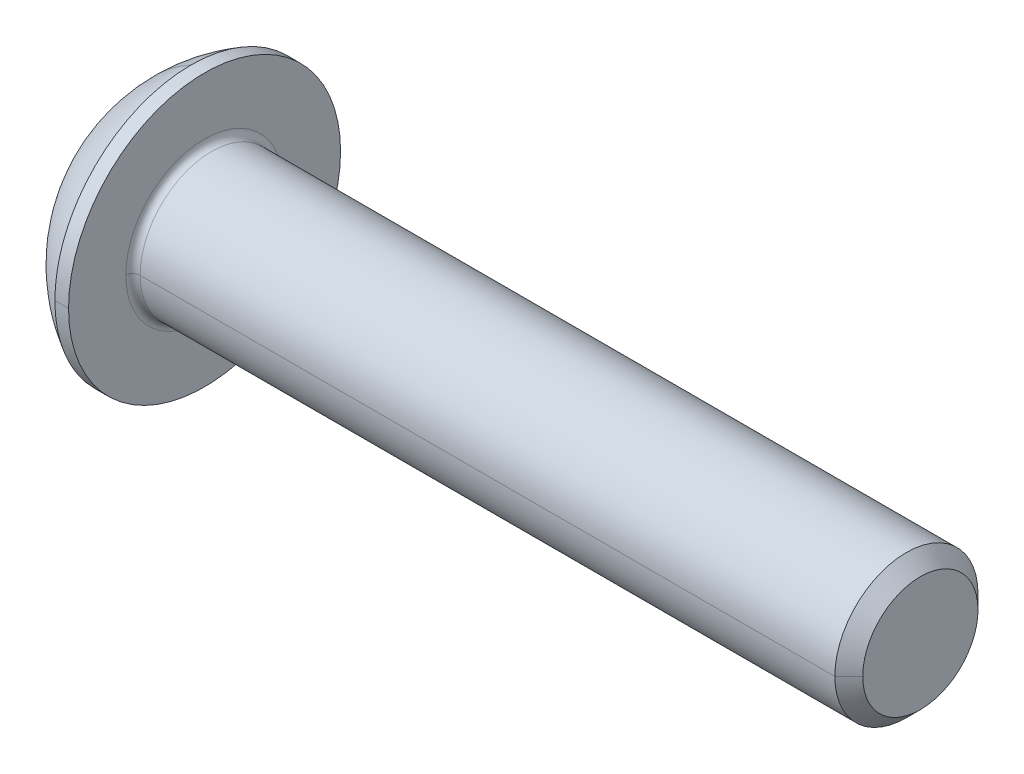
ISO-10303-21;
HEADER;
FILE_DESCRIPTION(('STEP AP214'),'2;1');
FILE_NAME('part.step','',(''),(''),'','','');
FILE_SCHEMA(('AUTOMOTIVE_DESIGN { 1 0 10303 214 1 1 1 1 }'));
ENDSEC;
DATA;
#1=APPLICATION_CONTEXT('core data for automotive mechanical design processes');
#2=APPLICATION_PROTOCOL_DEFINITION('international standard','automotive_design',2000,#1);
#3=PRODUCT_CONTEXT('',#1,'mechanical');
#4=PRODUCT('Part','Part','',(#3));
#5=PRODUCT_RELATED_PRODUCT_CATEGORY('part','',(#4));
#6=PRODUCT_DEFINITION_FORMATION('','',#4);
#7=PRODUCT_DEFINITION_CONTEXT('part definition',#1,'design');
#8=PRODUCT_DEFINITION('design','',#6,#7);
#9=PRODUCT_DEFINITION_SHAPE('','',#8);
#10=(LENGTH_UNIT() NAMED_UNIT(*) SI_UNIT(.MILLI.,.METRE.));
#11=(NAMED_UNIT(*) PLANE_ANGLE_UNIT() SI_UNIT($,.RADIAN.));
#12=(NAMED_UNIT(*) SI_UNIT($,.STERADIAN.) SOLID_ANGLE_UNIT());
#13=UNCERTAINTY_MEASURE_WITH_UNIT(LENGTH_MEASURE(1.E-05),#10,'distance_accuracy_value','');
#14=(GEOMETRIC_REPRESENTATION_CONTEXT(3) GLOBAL_UNCERTAINTY_ASSIGNED_CONTEXT((#13)) GLOBAL_UNIT_ASSIGNED_CONTEXT((#10,
#11,#12)) REPRESENTATION_CONTEXT('',''));
#15=CARTESIAN_POINT('',(0.,0.,0.));
#16=DIRECTION('',(0.,0.,1.));
#17=DIRECTION('',(1.,0.,0.));
#18=AXIS2_PLACEMENT_3D('',#15,#16,#17);
#19=CARTESIAN_POINT('',(-997.978312163513,0.,0.));
#20=DIRECTION('',(-1.,0.,0.));
#21=DIRECTION('',(0.,0.,1.));
#22=AXIS2_PLACEMENT_3D('',#19,#20,#21);
#23=CONICAL_SURFACE('',#22,1732.05080756885,1.0471975511966);
#24=DIRECTION('',(-0.5,0.,-0.866025403784436));
#25=VECTOR('',#24,1.);
#26=CARTESIAN_POINT('',(2.02168783648704,0.,0.));
#27=LINE('',#26,#25);
#28=CARTESIAN_POINT('',(2.02168783648704,0.,0.));
#29=VERTEX_POINT('',#28);
#30=CARTESIAN_POINT('',(1.3,0.,-1.25));
#31=VERTEX_POINT('',#30);
#32=EDGE_CURVE('E184',#29,#31,#27,.T.);
#33=ORIENTED_EDGE('',*,*,#32,.F.);
#34=DIRECTION('',(-0.5,0.,0.866025403784436));
#35=VECTOR('',#34,1.);
#36=CARTESIAN_POINT('',(2.02168783648704,0.,0.));
#37=LINE('',#36,#35);
#38=CARTESIAN_POINT('',(1.3,0.,1.25));
#39=VERTEX_POINT('',#38);
#40=EDGE_CURVE('E223',#29,#39,#37,.T.);
#41=ORIENTED_EDGE('',*,*,#40,.T.);
#42=CARTESIAN_POINT('',(1.3,0.,0.));
#43=DIRECTION('',(-1.,0.,0.));
#44=DIRECTION('',(0.,0.,1.));
#45=AXIS2_PLACEMENT_3D('',#42,#43,#44);
#46=CIRCLE('',#45,1.25);
#47=CARTESIAN_POINT('',(1.3,1.08253175473055,0.625));
#48=VERTEX_POINT('',#47);
#49=EDGE_CURVE('E11',#39,#48,#46,.T.);
#50=ORIENTED_EDGE('',*,*,#49,.T.);
#51=CARTESIAN_POINT('',(1.3,0.,0.));
#52=DIRECTION('',(-1.,0.,0.));
#53=DIRECTION('',(0.,0.,1.));
#54=AXIS2_PLACEMENT_3D('',#51,#52,#53);
#55=CIRCLE('',#54,1.25);
#56=CARTESIAN_POINT('',(1.3,1.08253175473055,-0.625));
#57=VERTEX_POINT('',#56);
#58=EDGE_CURVE('E20',#48,#57,#55,.T.);
#59=ORIENTED_EDGE('',*,*,#58,.T.);
#60=CARTESIAN_POINT('',(1.3,0.,0.));
#61=DIRECTION('',(-1.,0.,0.));
#62=DIRECTION('',(0.,0.,1.));
#63=AXIS2_PLACEMENT_3D('',#60,#61,#62);
#64=CIRCLE('',#63,1.25);
#65=EDGE_CURVE('E181',#57,#31,#64,.T.);
#66=ORIENTED_EDGE('',*,*,#65,.T.);
#67=EDGE_LOOP('',(#33,#41,#50,#59,#66));
#68=FACE_BOUND('',#67,.T.);
#69=ADVANCED_FACE('F16',(#68),#23,.F.);
#70=CARTESIAN_POINT('',(1.3,-1.44337567297406,0.));
#71=DIRECTION('',(1.,0.,0.));
#72=DIRECTION('',(0.,1.,0.));
#73=AXIS2_PLACEMENT_3D('',#70,#71,#72);
#74=PLANE('',#73);
#75=CARTESIAN_POINT('',(1.3,0.,0.));
#76=DIRECTION('',(-1.,0.,0.));
#77=DIRECTION('',(0.,0.,1.));
#78=AXIS2_PLACEMENT_3D('',#75,#76,#77);
#79=CIRCLE('',#78,1.25);
#80=CARTESIAN_POINT('',(1.3,-1.08253175473055,-0.625));
#81=VERTEX_POINT('',#80);
#82=EDGE_CURVE('E213',#31,#81,#79,.T.);
#83=ORIENTED_EDGE('',*,*,#82,.F.);
#84=DIRECTION('',(0.,1.,0.));
#85=VECTOR('',#84,1.);
#86=CARTESIAN_POINT('',(1.3,0.721687836487033,-1.25));
#87=LINE('',#86,#85);
#88=CARTESIAN_POINT('',(1.3,-0.721687836487032,-1.25));
#89=VERTEX_POINT('',#88);
#90=EDGE_CURVE('E201',#89,#31,#87,.T.);
#91=ORIENTED_EDGE('',*,*,#90,.F.);
#92=DIRECTION('',(0.,0.5,-0.866025403784439));
#93=VECTOR('',#92,1.);
#94=CARTESIAN_POINT('',(1.3,-0.721687836487032,-1.25));
#95=LINE('',#94,#93);
#96=EDGE_CURVE('E214',#81,#89,#95,.T.);
#97=ORIENTED_EDGE('',*,*,#96,.F.);
#98=EDGE_LOOP('',(#83,#91,#97));
#99=FACE_BOUND('',#98,.T.);
#100=ADVANCED_FACE('F18',(#99),#74,.F.);
#101=CARTESIAN_POINT('',(1.3,-1.44337567297406,0.));
#102=DIRECTION('',(1.,0.,0.));
#103=DIRECTION('',(0.,1.,0.));
#104=AXIS2_PLACEMENT_3D('',#101,#102,#103);
#105=PLANE('',#104);
#106=CARTESIAN_POINT('',(1.3,0.,0.));
#107=DIRECTION('',(-1.,0.,0.));
#108=DIRECTION('',(0.,0.,1.));
#109=AXIS2_PLACEMENT_3D('',#106,#107,#108);
#110=CIRCLE('',#109,1.25);
#111=CARTESIAN_POINT('',(1.3,-1.08253175473055,0.625));
#112=VERTEX_POINT('',#111);
#113=EDGE_CURVE('E219',#81,#112,#110,.T.);
#114=ORIENTED_EDGE('',*,*,#113,.F.);
#115=DIRECTION('',(0.,0.5,-0.866025403784439));
#116=VECTOR('',#115,1.);
#117=CARTESIAN_POINT('',(1.3,-0.721687836487032,-1.25));
#118=LINE('',#117,#116);
#119=CARTESIAN_POINT('',(1.3,-1.44337567297406,0.));
#120=VERTEX_POINT('',#119);
#121=EDGE_CURVE('E374',#120,#81,#118,.T.);
#122=ORIENTED_EDGE('',*,*,#121,.F.);
#123=DIRECTION('',(0.,-0.5,-0.866025403784439));
#124=VECTOR('',#123,1.);
#125=CARTESIAN_POINT('',(1.3,-1.44337567297406,0.));
#126=LINE('',#125,#124);
#127=EDGE_CURVE('E306',#112,#120,#126,.T.);
#128=ORIENTED_EDGE('',*,*,#127,.F.);
#129=EDGE_LOOP('',(#114,#122,#128));
#130=FACE_BOUND('',#129,.T.);
#131=ADVANCED_FACE('F414',(#130),#105,.F.);
#132=CARTESIAN_POINT('',(1.3,-1.44337567297406,0.));
#133=DIRECTION('',(1.,0.,0.));
#134=DIRECTION('',(0.,1.,0.));
#135=AXIS2_PLACEMENT_3D('',#132,#133,#134);
#136=PLANE('',#135);
#137=CARTESIAN_POINT('',(1.3,0.,0.));
#138=DIRECTION('',(-1.,0.,0.));
#139=DIRECTION('',(0.,0.,1.));
#140=AXIS2_PLACEMENT_3D('',#137,#138,#139);
#141=CIRCLE('',#140,1.25);
#142=EDGE_CURVE('E241',#112,#39,#141,.T.);
#143=ORIENTED_EDGE('',*,*,#142,.F.);
#144=DIRECTION('',(0.,-0.5,-0.866025403784439));
#145=VECTOR('',#144,1.);
#146=CARTESIAN_POINT('',(1.3,-1.44337567297406,0.));
#147=LINE('',#146,#145);
#148=CARTESIAN_POINT('',(1.3,-0.721687836487032,1.25));
#149=VERTEX_POINT('',#148);
#150=EDGE_CURVE('E365',#149,#112,#147,.T.);
#151=ORIENTED_EDGE('',*,*,#150,.F.);
#152=DIRECTION('',(0.,-1.,0.));
#153=VECTOR('',#152,1.);
#154=CARTESIAN_POINT('',(1.3,-0.721687836487032,1.25));
#155=LINE('',#154,#153);
#156=EDGE_CURVE('E189',#39,#149,#155,.T.);
#157=ORIENTED_EDGE('',*,*,#156,.F.);
#158=EDGE_LOOP('',(#143,#151,#157));
#159=FACE_BOUND('',#158,.T.);
#160=ADVANCED_FACE('F411',(#159),#136,.F.);
#161=CARTESIAN_POINT('',(1.3,-1.44337567297406,0.));
#162=DIRECTION('',(1.,0.,0.));
#163=DIRECTION('',(0.,1.,0.));
#164=AXIS2_PLACEMENT_3D('',#161,#162,#163);
#165=PLANE('',#164);
#166=ORIENTED_EDGE('',*,*,#49,.F.);
#167=DIRECTION('',(0.,-1.,0.));
#168=VECTOR('',#167,1.);
#169=CARTESIAN_POINT('',(1.3,-0.721687836487032,1.25));
#170=LINE('',#169,#168);
#171=CARTESIAN_POINT('',(1.3,0.721687836487033,1.25));
#172=VERTEX_POINT('',#171);
#173=EDGE_CURVE('E39',#172,#39,#170,.T.);
#174=ORIENTED_EDGE('',*,*,#173,.F.);
#175=DIRECTION('',(0.,-0.5,0.866025403784439));
#176=VECTOR('',#175,1.);
#177=CARTESIAN_POINT('',(1.3,0.721687836487033,1.25));
#178=LINE('',#177,#176);
#179=EDGE_CURVE('E381',#48,#172,#178,.T.);
#180=ORIENTED_EDGE('',*,*,#179,.F.);
#181=EDGE_LOOP('',(#166,#174,#180));
#182=FACE_BOUND('',#181,.T.);
#183=ADVANCED_FACE('F426',(#182),#165,.F.);
#184=CARTESIAN_POINT('',(1.3,-1.44337567297406,0.));
#185=DIRECTION('',(1.,0.,0.));
#186=DIRECTION('',(0.,1.,0.));
#187=AXIS2_PLACEMENT_3D('',#184,#185,#186);
#188=PLANE('',#187);
#189=ORIENTED_EDGE('',*,*,#58,.F.);
#190=DIRECTION('',(0.,-0.5,0.866025403784439));
#191=VECTOR('',#190,1.);
#192=CARTESIAN_POINT('',(1.3,0.721687836487033,1.25));
#193=LINE('',#192,#191);
#194=CARTESIAN_POINT('',(1.3,1.44337567297406,0.));
#195=VERTEX_POINT('',#194);
#196=EDGE_CURVE('E319',#195,#48,#193,.T.);
#197=ORIENTED_EDGE('',*,*,#196,.F.);
#198=DIRECTION('',(0.,0.5,0.866025403784439));
#199=VECTOR('',#198,1.);
#200=CARTESIAN_POINT('',(1.3,1.44337567297406,0.));
#201=LINE('',#200,#199);
#202=EDGE_CURVE('E320',#57,#195,#201,.T.);
#203=ORIENTED_EDGE('',*,*,#202,.F.);
#204=EDGE_LOOP('',(#189,#197,#203));
#205=FACE_BOUND('',#204,.T.);
#206=ADVANCED_FACE('F428',(#205),#188,.F.);
#207=CARTESIAN_POINT('',(1.3,-1.44337567297406,0.));
#208=DIRECTION('',(1.,0.,0.));
#209=DIRECTION('',(0.,1.,0.));
#210=AXIS2_PLACEMENT_3D('',#207,#208,#209);
#211=PLANE('',#210);
#212=ORIENTED_EDGE('',*,*,#65,.F.);
#213=DIRECTION('',(0.,0.5,0.866025403784439));
#214=VECTOR('',#213,1.);
#215=CARTESIAN_POINT('',(1.3,1.44337567297406,0.));
#216=LINE('',#215,#214);
#217=CARTESIAN_POINT('',(1.3,0.721687836487033,-1.25));
#218=VERTEX_POINT('',#217);
#219=EDGE_CURVE('E196',#218,#57,#216,.T.);
#220=ORIENTED_EDGE('',*,*,#219,.F.);
#221=DIRECTION('',(0.,1.,0.));
#222=VECTOR('',#221,1.);
#223=CARTESIAN_POINT('',(1.3,0.721687836487033,-1.25));
#224=LINE('',#223,#222);
#225=EDGE_CURVE('E192',#31,#218,#224,.T.);
#226=ORIENTED_EDGE('',*,*,#225,.F.);
#227=EDGE_LOOP('',(#212,#220,#226));
#228=FACE_BOUND('',#227,.T.);
#229=ADVANCED_FACE('F194',(#228),#211,.F.);
#230=CARTESIAN_POINT('',(1.3,-0.721687836487032,1.25));
#231=DIRECTION('',(0.,0.,-1.));
#232=DIRECTION('',(0.,-1.,0.));
#233=AXIS2_PLACEMENT_3D('',#230,#231,#232);
#234=PLANE('',#233);
#235=ORIENTED_EDGE('',*,*,#173,.T.);
#236=ORIENTED_EDGE('',*,*,#156,.T.);
#237=DIRECTION('',(-1.,0.,0.));
#238=VECTOR('',#237,1.);
#239=CARTESIAN_POINT('',(1.3,-0.721687836487032,1.25));
#240=LINE('',#239,#238);
#241=CARTESIAN_POINT('',(0.,-0.721687836487032,1.25));
#242=VERTEX_POINT('',#241);
#243=EDGE_CURVE('E305',#149,#242,#240,.T.);
#244=ORIENTED_EDGE('',*,*,#243,.T.);
#245=DIRECTION('',(0.,-1.,0.));
#246=VECTOR('',#245,1.);
#247=CARTESIAN_POINT('',(0.,-0.721687836487032,1.25));
#248=LINE('',#247,#246);
#249=CARTESIAN_POINT('',(0.,0.721687836487033,1.25));
#250=VERTEX_POINT('',#249);
#251=EDGE_CURVE('E326',#250,#242,#248,.T.);
#252=ORIENTED_EDGE('',*,*,#251,.F.);
#253=DIRECTION('',(-1.,0.,0.));
#254=VECTOR('',#253,1.);
#255=CARTESIAN_POINT('',(1.3,0.721687836487033,1.25));
#256=LINE('',#255,#254);
#257=EDGE_CURVE('E385',#172,#250,#256,.T.);
#258=ORIENTED_EDGE('',*,*,#257,.F.);
#259=EDGE_LOOP('',(#235,#236,#244,#252,#258));
#260=FACE_BOUND('',#259,.T.);
#261=ADVANCED_FACE('F403',(#260),#234,.T.);
#262=CARTESIAN_POINT('',(1.3,0.721687836487033,1.25));
#263=DIRECTION('',(0.,-0.866025403784439,-0.5));
#264=DIRECTION('',(0.,0.5,-0.866025403784439));
#265=AXIS2_PLACEMENT_3D('',#262,#263,#264);
#266=PLANE('',#265);
#267=ORIENTED_EDGE('',*,*,#196,.T.);
#268=ORIENTED_EDGE('',*,*,#179,.T.);
#269=ORIENTED_EDGE('',*,*,#257,.T.);
#270=DIRECTION('',(0.,-0.5,0.866025403784439));
#271=VECTOR('',#270,1.);
#272=CARTESIAN_POINT('',(0.,0.721687836487033,1.25));
#273=LINE('',#272,#271);
#274=CARTESIAN_POINT('',(0.,1.44337567297406,0.));
#275=VERTEX_POINT('',#274);
#276=EDGE_CURVE('E346',#275,#250,#273,.T.);
#277=ORIENTED_EDGE('',*,*,#276,.F.);
#278=DIRECTION('',(-1.,0.,0.));
#279=VECTOR('',#278,1.);
#280=CARTESIAN_POINT('',(1.3,1.44337567297406,0.));
#281=LINE('',#280,#279);
#282=EDGE_CURVE('E316',#195,#275,#281,.T.);
#283=ORIENTED_EDGE('',*,*,#282,.F.);
#284=EDGE_LOOP('',(#267,#268,#269,#277,#283));
#285=FACE_BOUND('',#284,.T.);
#286=ADVANCED_FACE('F424',(#285),#266,.T.);
#287=CARTESIAN_POINT('',(1.3,1.44337567297406,0.));
#288=DIRECTION('',(0.,-0.866025403784439,0.5));
#289=DIRECTION('',(-1.,0.,0.));
#290=AXIS2_PLACEMENT_3D('',#287,#288,#289);
#291=PLANE('',#290);
#292=ORIENTED_EDGE('',*,*,#219,.T.);
#293=ORIENTED_EDGE('',*,*,#202,.T.);
#294=ORIENTED_EDGE('',*,*,#282,.T.);
#295=DIRECTION('',(0.,0.5,0.866025403784439));
#296=VECTOR('',#295,1.);
#297=CARTESIAN_POINT('',(0.,1.44337567297406,0.));
#298=LINE('',#297,#296);
#299=CARTESIAN_POINT('',(0.,0.721687836487033,-1.25));
#300=VERTEX_POINT('',#299);
#301=EDGE_CURVE('E342',#300,#275,#298,.T.);
#302=ORIENTED_EDGE('',*,*,#301,.F.);
#303=DIRECTION('',(-1.,0.,0.));
#304=VECTOR('',#303,1.);
#305=CARTESIAN_POINT('',(1.3,0.721687836487033,-1.25));
#306=LINE('',#305,#304);
#307=EDGE_CURVE('E200',#218,#300,#306,.T.);
#308=ORIENTED_EDGE('',*,*,#307,.F.);
#309=EDGE_LOOP('',(#292,#293,#294,#302,#308));
#310=FACE_BOUND('',#309,.T.);
#311=ADVANCED_FACE('F449',(#310),#291,.T.);
#312=CARTESIAN_POINT('',(1.3,0.721687836487033,-1.25));
#313=DIRECTION('',(0.,0.,1.));
#314=DIRECTION('',(1.,0.,0.));
#315=AXIS2_PLACEMENT_3D('',#312,#313,#314);
#316=PLANE('',#315);
#317=ORIENTED_EDGE('',*,*,#90,.T.);
#318=ORIENTED_EDGE('',*,*,#225,.T.);
#319=ORIENTED_EDGE('',*,*,#307,.T.);
#320=DIRECTION('',(0.,1.,0.));
#321=VECTOR('',#320,1.);
#322=CARTESIAN_POINT('',(0.,0.721687836487033,-1.25));
#323=LINE('',#322,#321);
#324=CARTESIAN_POINT('',(0.,-0.721687836487032,-1.25));
#325=VERTEX_POINT('',#324);
#326=EDGE_CURVE('E338',#325,#300,#323,.T.);
#327=ORIENTED_EDGE('',*,*,#326,.F.);
#328=DIRECTION('',(-1.,0.,0.));
#329=VECTOR('',#328,1.);
#330=CARTESIAN_POINT('',(1.3,-0.721687836487032,-1.25));
#331=LINE('',#330,#329);
#332=EDGE_CURVE('E207',#89,#325,#331,.T.);
#333=ORIENTED_EDGE('',*,*,#332,.F.);
#334=EDGE_LOOP('',(#317,#318,#319,#327,#333));
#335=FACE_BOUND('',#334,.T.);
#336=ADVANCED_FACE('F205',(#335),#316,.T.);
#337=CARTESIAN_POINT('',(1.3,-0.721687836487032,-1.25));
#338=DIRECTION('',(0.,0.866025403784439,0.5));
#339=DIRECTION('',(1.,0.,0.));
#340=AXIS2_PLACEMENT_3D('',#337,#338,#339);
#341=PLANE('',#340);
#342=ORIENTED_EDGE('',*,*,#121,.T.);
#343=ORIENTED_EDGE('',*,*,#96,.T.);
#344=ORIENTED_EDGE('',*,*,#332,.T.);
#345=DIRECTION('',(0.,0.5,-0.866025403784439));
#346=VECTOR('',#345,1.);
#347=CARTESIAN_POINT('',(0.,-0.721687836487032,-1.25));
#348=LINE('',#347,#346);
#349=CARTESIAN_POINT('',(0.,-1.44337567297406,0.));
#350=VERTEX_POINT('',#349);
#351=EDGE_CURVE('E334',#350,#325,#348,.T.);
#352=ORIENTED_EDGE('',*,*,#351,.F.);
#353=DIRECTION('',(-1.,0.,0.));
#354=VECTOR('',#353,1.);
#355=CARTESIAN_POINT('',(1.3,-1.44337567297406,0.));
#356=LINE('',#355,#354);
#357=EDGE_CURVE('E302',#120,#350,#356,.T.);
#358=ORIENTED_EDGE('',*,*,#357,.F.);
#359=EDGE_LOOP('',(#342,#343,#344,#352,#358));
#360=FACE_BOUND('',#359,.T.);
#361=ADVANCED_FACE('F418',(#360),#341,.T.);
#362=CARTESIAN_POINT('',(1.3,-1.44337567297406,0.));
#363=DIRECTION('',(0.,0.866025403784439,-0.5));
#364=DIRECTION('',(-1.,0.,0.));
#365=AXIS2_PLACEMENT_3D('',#362,#363,#364);
#366=PLANE('',#365);
#367=ORIENTED_EDGE('',*,*,#150,.T.);
#368=ORIENTED_EDGE('',*,*,#127,.T.);
#369=ORIENTED_EDGE('',*,*,#357,.T.);
#370=DIRECTION('',(0.,-0.5,-0.866025403784439));
#371=VECTOR('',#370,1.);
#372=CARTESIAN_POINT('',(0.,-1.44337567297406,0.));
#373=LINE('',#372,#371);
#374=EDGE_CURVE('E330',#242,#350,#373,.T.);
#375=ORIENTED_EDGE('',*,*,#374,.F.);
#376=ORIENTED_EDGE('',*,*,#243,.F.);
#377=EDGE_LOOP('',(#367,#368,#369,#375,#376));
#378=FACE_BOUND('',#377,.T.);
#379=ADVANCED_FACE('F410',(#378),#366,.T.);
#380=CARTESIAN_POINT('',(2.4,0.,0.));
#381=DIRECTION('',(-1.,0.,0.));
#382=DIRECTION('',(0.,0.,1.));
#383=AXIS2_PLACEMENT_3D('',#380,#381,#382);
#384=TOROIDAL_SURFACE('',#383,2.2,0.2);
#385=CARTESIAN_POINT('',(2.4,0.,-2.2));
#386=DIRECTION('',(0.,1.,0.));
#387=DIRECTION('',(0.,0.,1.));
#388=AXIS2_PLACEMENT_3D('',#385,#386,#387);
#389=CIRCLE('',#388,0.2);
#390=CARTESIAN_POINT('',(2.2,0.,-2.2));
#391=VERTEX_POINT('',#390);
#392=CARTESIAN_POINT('',(2.4,0.,-2.));
#393=VERTEX_POINT('',#392);
#394=EDGE_CURVE('E262',#391,#393,#389,.T.);
#395=ORIENTED_EDGE('',*,*,#394,.F.);
#396=CARTESIAN_POINT('',(2.2,0.,0.));
#397=DIRECTION('',(-1.,0.,0.));
#398=DIRECTION('',(0.,0.,1.));
#399=AXIS2_PLACEMENT_3D('',#396,#397,#398);
#400=CIRCLE('',#399,2.2);
#401=CARTESIAN_POINT('',(2.2,0.,2.2));
#402=VERTEX_POINT('',#401);
#403=EDGE_CURVE('E356',#402,#391,#400,.T.);
#404=ORIENTED_EDGE('',*,*,#403,.F.);
#405=CARTESIAN_POINT('',(2.4,0.,2.2));
#406=DIRECTION('',(0.,-1.,0.));
#407=DIRECTION('',(0.,0.,-1.));
#408=AXIS2_PLACEMENT_3D('',#405,#406,#407);
#409=CIRCLE('',#408,0.2);
#410=CARTESIAN_POINT('',(2.4,0.,2.));
#411=VERTEX_POINT('',#410);
#412=EDGE_CURVE('E238',#402,#411,#409,.T.);
#413=ORIENTED_EDGE('',*,*,#412,.T.);
#414=CARTESIAN_POINT('',(2.4,0.,0.));
#415=DIRECTION('',(1.,0.,0.));
#416=DIRECTION('',(0.,0.,1.));
#417=AXIS2_PLACEMENT_3D('',#414,#415,#416);
#418=CIRCLE('',#417,2.);
#419=EDGE_CURVE('E274',#393,#411,#418,.T.);
#420=ORIENTED_EDGE('',*,*,#419,.F.);
#421=EDGE_LOOP('',(#395,#404,#413,#420));
#422=FACE_BOUND('',#421,.T.);
#423=ADVANCED_FACE('F453',(#422),#384,.F.);
#424=CARTESIAN_POINT('',(22.2,0.,0.));
#425=DIRECTION('',(-1.,0.,0.));
#426=DIRECTION('',(0.,0.,1.));
#427=AXIS2_PLACEMENT_3D('',#424,#425,#426);
#428=PLANE('',#427);
#429=CARTESIAN_POINT('',(22.2,0.,0.));
#430=DIRECTION('',(-1.,0.,0.));
#431=DIRECTION('',(0.,0.,1.));
#432=AXIS2_PLACEMENT_3D('',#429,#430,#431);
#433=CIRCLE('',#432,1.61);
#434=CARTESIAN_POINT('',(22.2,0.,1.61));
#435=VERTEX_POINT('',#434);
#436=CARTESIAN_POINT('',(22.2,0.,-1.61));
#437=VERTEX_POINT('',#436);
#438=EDGE_CURVE('E234',#435,#437,#433,.T.);
#439=ORIENTED_EDGE('',*,*,#438,.F.);
#440=CARTESIAN_POINT('',(22.2,0.,0.));
#441=DIRECTION('',(-1.,0.,0.));
#442=DIRECTION('',(0.,0.,1.));
#443=AXIS2_PLACEMENT_3D('',#440,#441,#442);
#444=CIRCLE('',#443,1.61);
#445=EDGE_CURVE('E362',#437,#435,#444,.T.);
#446=ORIENTED_EDGE('',*,*,#445,.F.);
#447=EDGE_LOOP('',(#439,#446));
#448=FACE_BOUND('',#447,.T.);
#449=ADVANCED_FACE('F456',(#448),#428,.F.);
#450=CARTESIAN_POINT('',(22.2,0.,0.));
#451=DIRECTION('',(-1.,0.,0.));
#452=DIRECTION('',(0.,0.,1.));
#453=AXIS2_PLACEMENT_3D('',#450,#451,#452);
#454=CONICAL_SURFACE('',#453,1.61,0.785398163397442);
#455=DIRECTION('',(-0.707106781186552,0.,-0.707106781186543));
#456=VECTOR('',#455,1.);
#457=CARTESIAN_POINT('',(22.2,0.,-1.61));
#458=LINE('',#457,#456);
#459=CARTESIAN_POINT('',(21.81,0.,-2.));
#460=VERTEX_POINT('',#459);
#461=EDGE_CURVE('E237',#437,#460,#458,.T.);
#462=ORIENTED_EDGE('',*,*,#461,.F.);
#463=ORIENTED_EDGE('',*,*,#445,.T.);
#464=DIRECTION('',(-0.707106781186552,0.,0.707106781186543));
#465=VECTOR('',#464,1.);
#466=CARTESIAN_POINT('',(22.2,0.,1.61));
#467=LINE('',#466,#465);
#468=CARTESIAN_POINT('',(21.81,0.,2.));
#469=VERTEX_POINT('',#468);
#470=EDGE_CURVE('E233',#435,#469,#467,.T.);
#471=ORIENTED_EDGE('',*,*,#470,.T.);
#472=CARTESIAN_POINT('',(21.81,0.,0.));
#473=DIRECTION('',(-1.,0.,0.));
#474=DIRECTION('',(0.,0.,1.));
#475=AXIS2_PLACEMENT_3D('',#472,#473,#474);
#476=CIRCLE('',#475,2.);
#477=EDGE_CURVE('E359',#460,#469,#476,.T.);
#478=ORIENTED_EDGE('',*,*,#477,.F.);
#479=EDGE_LOOP('',(#462,#463,#471,#478));
#480=FACE_BOUND('',#479,.T.);
#481=ADVANCED_FACE('F460',(#480),#454,.T.);
#482=CARTESIAN_POINT('',(0.,0.,0.));
#483=DIRECTION('',(-1.,0.,0.));
#484=DIRECTION('',(0.,0.,1.));
#485=AXIS2_PLACEMENT_3D('',#482,#483,#484);
#486=CYLINDRICAL_SURFACE('',#485,2.);
#487=DIRECTION('',(-1.,0.,0.));
#488=VECTOR('',#487,1.);
#489=CARTESIAN_POINT('',(0.,0.,-2.));
#490=LINE('',#489,#488);
#491=EDGE_CURVE('E278',#460,#393,#490,.T.);
#492=ORIENTED_EDGE('',*,*,#491,.F.);
#493=ORIENTED_EDGE('',*,*,#477,.T.);
#494=DIRECTION('',(-1.,0.,0.));
#495=VECTOR('',#494,1.);
#496=CARTESIAN_POINT('',(0.,0.,2.));
#497=LINE('',#496,#495);
#498=EDGE_CURVE('E277',#469,#411,#497,.T.);
#499=ORIENTED_EDGE('',*,*,#498,.T.);
#500=CARTESIAN_POINT('',(2.4,0.,0.));
#501=DIRECTION('',(1.,0.,0.));
#502=DIRECTION('',(0.,0.,1.));
#503=AXIS2_PLACEMENT_3D('',#500,#501,#502);
#504=CIRCLE('',#503,2.);
#505=EDGE_CURVE('E263',#411,#393,#504,.T.);
#506=ORIENTED_EDGE('',*,*,#505,.T.);
#507=EDGE_LOOP('',(#492,#493,#499,#506));
#508=FACE_BOUND('',#507,.T.);
#509=ADVANCED_FACE('F472',(#508),#486,.T.);
#510=CARTESIAN_POINT('',(2.2,2.,0.));
#511=DIRECTION('',(-1.,0.,0.));
#512=DIRECTION('',(0.,0.,1.));
#513=AXIS2_PLACEMENT_3D('',#510,#511,#512);
#514=PLANE('',#513);
#515=ORIENTED_EDGE('',*,*,#403,.T.);
#516=CARTESIAN_POINT('',(2.2,0.,0.));
#517=DIRECTION('',(-1.,0.,0.));
#518=DIRECTION('',(0.,0.,1.));
#519=AXIS2_PLACEMENT_3D('',#516,#517,#518);
#520=CIRCLE('',#519,2.2);
#521=EDGE_CURVE('E245',#391,#402,#520,.T.);
#522=ORIENTED_EDGE('',*,*,#521,.T.);
#523=EDGE_LOOP('',(#515,#522));
#524=FACE_BOUND('',#523,.T.);
#525=CARTESIAN_POINT('',(2.2,0.,0.));
#526=DIRECTION('',(-1.,0.,0.));
#527=DIRECTION('',(0.,0.,1.));
#528=AXIS2_PLACEMENT_3D('',#525,#526,#527);
#529=CIRCLE('',#528,3.8);
#530=CARTESIAN_POINT('',(2.2,0.,3.8));
#531=VERTEX_POINT('',#530);
#532=CARTESIAN_POINT('',(2.2,0.,-3.8));
#533=VERTEX_POINT('',#532);
#534=EDGE_CURVE('E293',#531,#533,#529,.T.);
#535=ORIENTED_EDGE('',*,*,#534,.F.);
#536=CARTESIAN_POINT('',(2.2,0.,0.));
#537=DIRECTION('',(-1.,0.,0.));
#538=DIRECTION('',(0.,0.,1.));
#539=AXIS2_PLACEMENT_3D('',#536,#537,#538);
#540=CIRCLE('',#539,3.8);
#541=EDGE_CURVE('E353',#533,#531,#540,.T.);
#542=ORIENTED_EDGE('',*,*,#541,.F.);
#543=EDGE_LOOP('',(#535,#542));
#544=FACE_BOUND('',#543,.T.);
#545=ADVANCED_FACE('F468',(#524,#544),#514,.F.);
#546=CARTESIAN_POINT('',(0.,0.,0.));
#547=DIRECTION('',(-1.,0.,0.));
#548=DIRECTION('',(0.,0.,1.));
#549=AXIS2_PLACEMENT_3D('',#546,#547,#548);
#550=CYLINDRICAL_SURFACE('',#549,3.8);
#551=DIRECTION('',(-1.,0.,0.));
#552=VECTOR('',#551,1.);
#553=CARTESIAN_POINT('',(0.,0.,-3.8));
#554=LINE('',#553,#552);
#555=CARTESIAN_POINT('',(1.82,0.,-3.8));
#556=VERTEX_POINT('',#555);
#557=EDGE_CURVE('E297',#533,#556,#554,.T.);
#558=ORIENTED_EDGE('',*,*,#557,.F.);
#559=ORIENTED_EDGE('',*,*,#541,.T.);
#560=DIRECTION('',(-1.,0.,0.));
#561=VECTOR('',#560,1.);
#562=CARTESIAN_POINT('',(0.,0.,3.8));
#563=LINE('',#562,#561);
#564=CARTESIAN_POINT('',(1.82,0.,3.8));
#565=VERTEX_POINT('',#564);
#566=EDGE_CURVE('E283',#531,#565,#563,.T.);
#567=ORIENTED_EDGE('',*,*,#566,.T.);
#568=CARTESIAN_POINT('',(1.82,0.,0.));
#569=DIRECTION('',(-1.,0.,0.));
#570=DIRECTION('',(0.,0.,1.));
#571=AXIS2_PLACEMENT_3D('',#568,#569,#570);
#572=CIRCLE('',#571,3.8);
#573=CARTESIAN_POINT('',(1.82,-3.8,0.));
#574=VERTEX_POINT('',#573);
#575=EDGE_CURVE('E350',#574,#565,#572,.T.);
#576=ORIENTED_EDGE('',*,*,#575,.F.);
#577=CARTESIAN_POINT('',(1.82,0.,0.));
#578=DIRECTION('',(-1.,0.,0.));
#579=DIRECTION('',(0.,0.,1.));
#580=AXIS2_PLACEMENT_3D('',#577,#578,#579);
#581=CIRCLE('',#580,3.8);
#582=EDGE_CURVE('E258',#556,#574,#581,.T.);
#583=ORIENTED_EDGE('',*,*,#582,.F.);
#584=EDGE_LOOP('',(#558,#559,#567,#576,#583));
#585=FACE_BOUND('',#584,.T.);
#586=ADVANCED_FACE('F464',(#585),#550,.T.);
#587=CARTESIAN_POINT('',(3.88527472527473,0.,0.));
#588=DIRECTION('',(0.,0.,-1.));
#589=DIRECTION('',(0.,1.,0.));
#590=AXIS2_PLACEMENT_3D('',#587,#588,#589);
#591=SPHERICAL_SURFACE('',#590,4.3249693283142);
#592=CARTESIAN_POINT('',(3.88527472527473,0.,0.));
#593=DIRECTION('',(0.,0.,-1.));
#594=DIRECTION('',(0.,1.,0.));
#595=AXIS2_PLACEMENT_3D('',#592,#593,#594);
#596=CIRCLE('',#595,4.3249693283142);
#597=CARTESIAN_POINT('',(0.,-1.9,0.));
#598=VERTEX_POINT('',#597);
#599=EDGE_CURVE('E254',#574,#598,#596,.T.);
#600=ORIENTED_EDGE('',*,*,#599,.F.);
#601=ORIENTED_EDGE('',*,*,#575,.T.);
#602=CARTESIAN_POINT('',(1.82,0.,0.));
#603=DIRECTION('',(-1.,0.,0.));
#604=DIRECTION('',(0.,0.,1.));
#605=AXIS2_PLACEMENT_3D('',#602,#603,#604);
#606=CIRCLE('',#605,3.8);
#607=CARTESIAN_POINT('',(1.82,3.8,0.));
#608=VERTEX_POINT('',#607);
#609=EDGE_CURVE('E287',#565,#608,#606,.T.);
#610=ORIENTED_EDGE('',*,*,#609,.T.);
#611=CARTESIAN_POINT('',(3.88527472527473,0.,0.));
#612=DIRECTION('',(0.,0.,1.));
#613=DIRECTION('',(1.,0.,0.));
#614=AXIS2_PLACEMENT_3D('',#611,#612,#613);
#615=CIRCLE('',#614,4.3249693283142);
#616=CARTESIAN_POINT('',(0.,1.9,0.));
#617=VERTEX_POINT('',#616);
#618=EDGE_CURVE('E248',#608,#617,#615,.T.);
#619=ORIENTED_EDGE('',*,*,#618,.T.);
#620=CARTESIAN_POINT('',(0.,0.,0.));
#621=DIRECTION('',(-1.,0.,0.));
#622=DIRECTION('',(0.,0.,1.));
#623=AXIS2_PLACEMENT_3D('',#620,#621,#622);
#624=CIRCLE('',#623,1.9);
#625=EDGE_CURVE('E252',#598,#617,#624,.T.);
#626=ORIENTED_EDGE('',*,*,#625,.F.);
#627=EDGE_LOOP('',(#600,#601,#610,#619,#626));
#628=FACE_BOUND('',#627,.T.);
#629=ADVANCED_FACE('F467',(#628),#591,.T.);
#630=CARTESIAN_POINT('',(0.,0.,0.));
#631=DIRECTION('',(-1.,0.,0.));
#632=DIRECTION('',(0.,0.,1.));
#633=AXIS2_PLACEMENT_3D('',#630,#631,#632);
#634=PLANE('',#633);
#635=ORIENTED_EDGE('',*,*,#251,.T.);
#636=ORIENTED_EDGE('',*,*,#374,.T.);
#637=ORIENTED_EDGE('',*,*,#351,.T.);
#638=ORIENTED_EDGE('',*,*,#326,.T.);
#639=ORIENTED_EDGE('',*,*,#301,.T.);
#640=ORIENTED_EDGE('',*,*,#276,.T.);
#641=EDGE_LOOP('',(#635,#636,#637,#638,#639,#640));
#642=FACE_BOUND('',#641,.T.);
#643=CARTESIAN_POINT('',(0.,0.,0.));
#644=DIRECTION('',(-1.,0.,0.));
#645=DIRECTION('',(0.,0.,1.));
#646=AXIS2_PLACEMENT_3D('',#643,#644,#645);
#647=CIRCLE('',#646,1.9);
#648=EDGE_CURVE('E253',#617,#598,#647,.T.);
#649=ORIENTED_EDGE('',*,*,#648,.T.);
#650=ORIENTED_EDGE('',*,*,#625,.T.);
#651=EDGE_LOOP('',(#649,#650));
#652=FACE_BOUND('',#651,.T.);
#653=ADVANCED_FACE('F420',(#642,#652),#634,.T.);
#654=CARTESIAN_POINT('',(3.88527472527473,0.,0.));
#655=DIRECTION('',(0.,0.,-1.));
#656=DIRECTION('',(0.,1.,0.));
#657=AXIS2_PLACEMENT_3D('',#654,#655,#656);
#658=SPHERICAL_SURFACE('',#657,4.3249693283142);
#659=CARTESIAN_POINT('',(1.82,0.,0.));
#660=DIRECTION('',(-1.,0.,0.));
#661=DIRECTION('',(0.,0.,1.));
#662=AXIS2_PLACEMENT_3D('',#659,#660,#661);
#663=CIRCLE('',#662,3.8);
#664=EDGE_CURVE('E301',#608,#556,#663,.T.);
#665=ORIENTED_EDGE('',*,*,#664,.T.);
#666=ORIENTED_EDGE('',*,*,#582,.T.);
#667=ORIENTED_EDGE('',*,*,#599,.T.);
#668=ORIENTED_EDGE('',*,*,#648,.F.);
#669=ORIENTED_EDGE('',*,*,#618,.F.);
#670=EDGE_LOOP('',(#665,#666,#667,#668,#669));
#671=FACE_BOUND('',#670,.T.);
#672=ADVANCED_FACE('F479',(#671),#658,.T.);
#673=CARTESIAN_POINT('',(0.,0.,0.));
#674=DIRECTION('',(-1.,0.,0.));
#675=DIRECTION('',(0.,0.,1.));
#676=AXIS2_PLACEMENT_3D('',#673,#674,#675);
#677=CYLINDRICAL_SURFACE('',#676,3.8);
#678=ORIENTED_EDGE('',*,*,#534,.T.);
#679=ORIENTED_EDGE('',*,*,#557,.T.);
#680=ORIENTED_EDGE('',*,*,#664,.F.);
#681=ORIENTED_EDGE('',*,*,#609,.F.);
#682=ORIENTED_EDGE('',*,*,#566,.F.);
#683=EDGE_LOOP('',(#678,#679,#680,#681,#682));
#684=FACE_BOUND('',#683,.T.);
#685=ADVANCED_FACE('F482',(#684),#677,.T.);
#686=CARTESIAN_POINT('',(0.,0.,0.));
#687=DIRECTION('',(-1.,0.,0.));
#688=DIRECTION('',(0.,0.,1.));
#689=AXIS2_PLACEMENT_3D('',#686,#687,#688);
#690=CYLINDRICAL_SURFACE('',#689,2.);
#691=CARTESIAN_POINT('',(21.81,0.,0.));
#692=DIRECTION('',(-1.,0.,0.));
#693=DIRECTION('',(0.,0.,1.));
#694=AXIS2_PLACEMENT_3D('',#691,#692,#693);
#695=CIRCLE('',#694,2.);
#696=EDGE_CURVE('E273',#469,#460,#695,.T.);
#697=ORIENTED_EDGE('',*,*,#696,.T.);
#698=ORIENTED_EDGE('',*,*,#491,.T.);
#699=ORIENTED_EDGE('',*,*,#419,.T.);
#700=ORIENTED_EDGE('',*,*,#498,.F.);
#701=EDGE_LOOP('',(#697,#698,#699,#700));
#702=FACE_BOUND('',#701,.T.);
#703=ADVANCED_FACE('F486',(#702),#690,.T.);
#704=CARTESIAN_POINT('',(22.2,0.,0.));
#705=DIRECTION('',(-1.,0.,0.));
#706=DIRECTION('',(0.,0.,1.));
#707=AXIS2_PLACEMENT_3D('',#704,#705,#706);
#708=CONICAL_SURFACE('',#707,1.61,0.785398163397442);
#709=ORIENTED_EDGE('',*,*,#438,.T.);
#710=ORIENTED_EDGE('',*,*,#461,.T.);
#711=ORIENTED_EDGE('',*,*,#696,.F.);
#712=ORIENTED_EDGE('',*,*,#470,.F.);
#713=EDGE_LOOP('',(#709,#710,#711,#712));
#714=FACE_BOUND('',#713,.T.);
#715=ADVANCED_FACE('F489',(#714),#708,.T.);
#716=CARTESIAN_POINT('',(2.4,0.,0.));
#717=DIRECTION('',(-1.,0.,0.));
#718=DIRECTION('',(0.,0.,1.));
#719=AXIS2_PLACEMENT_3D('',#716,#717,#718);
#720=TOROIDAL_SURFACE('',#719,2.2,0.2);
#721=ORIENTED_EDGE('',*,*,#521,.F.);
#722=ORIENTED_EDGE('',*,*,#394,.T.);
#723=ORIENTED_EDGE('',*,*,#505,.F.);
#724=ORIENTED_EDGE('',*,*,#412,.F.);
#725=EDGE_LOOP('',(#721,#722,#723,#724));
#726=FACE_BOUND('',#725,.T.);
#727=ADVANCED_FACE('F493',(#726),#720,.F.);
#728=CARTESIAN_POINT('',(-997.978312163513,0.,0.));
#729=DIRECTION('',(-1.,0.,0.));
#730=DIRECTION('',(0.,0.,1.));
#731=AXIS2_PLACEMENT_3D('',#728,#729,#730);
#732=CONICAL_SURFACE('',#731,1732.05080756885,1.0471975511966);
#733=ORIENTED_EDGE('',*,*,#40,.F.);
#734=ORIENTED_EDGE('',*,*,#32,.T.);
#735=ORIENTED_EDGE('',*,*,#82,.T.);
#736=ORIENTED_EDGE('',*,*,#113,.T.);
#737=ORIENTED_EDGE('',*,*,#142,.T.);
#738=EDGE_LOOP('',(#733,#734,#735,#736,#737));
#739=FACE_BOUND('',#738,.T.);
#740=ADVANCED_FACE('F221',(#739),#732,.F.);
#741=CLOSED_SHELL('',(#69,#100,#131,#160,#183,#206,#229,#261,#286,#311,#336,#361,#379,#423,#449,
#481,#509,#545,#586,#629,#653,#672,#685,#703,#715,#727,#740));
#742=MANIFOLD_SOLID_BREP('B1',#741);
#743=ADVANCED_BREP_SHAPE_REPRESENTATION('',(#18,#742),#14);
#744=SHAPE_DEFINITION_REPRESENTATION(#9,#743);
ENDSEC;
END-ISO-10303-21;
